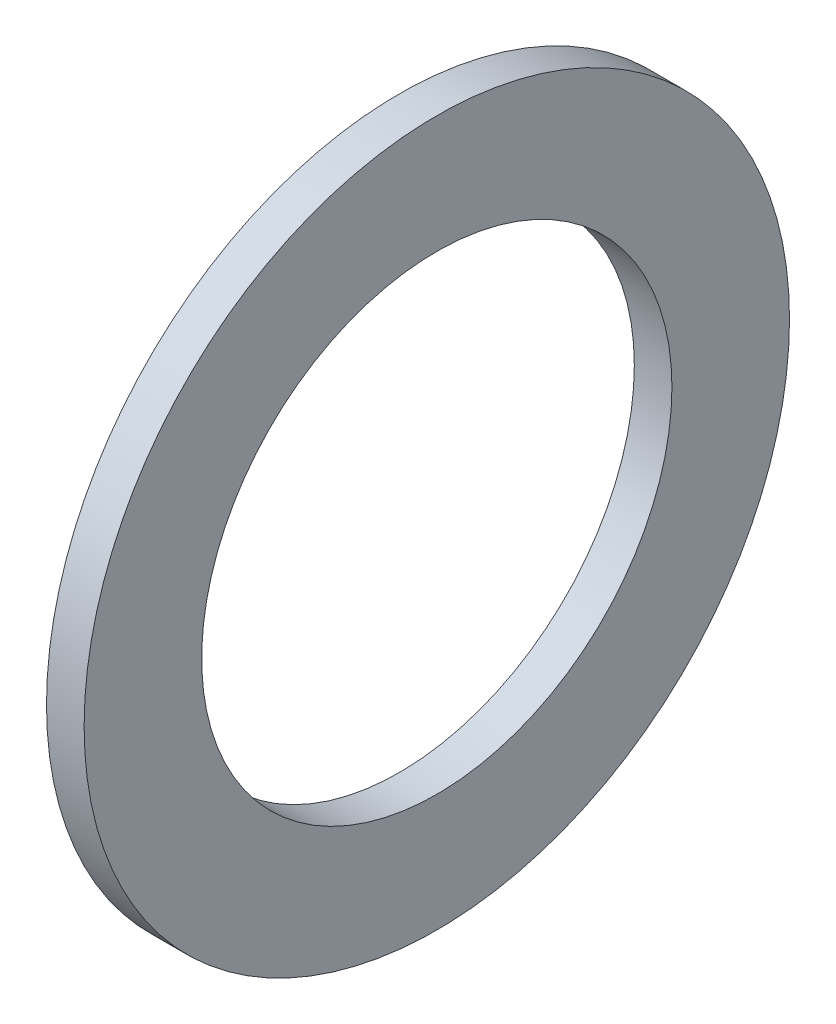
ISO-10303-21;
HEADER;
FILE_DESCRIPTION(('STEP AP214'),'2;1');
FILE_NAME('part.step','',(''),(''),'','','');
FILE_SCHEMA(('AUTOMOTIVE_DESIGN { 1 0 10303 214 1 1 1 1 }'));
ENDSEC;
DATA;
#1=APPLICATION_CONTEXT('core data for automotive mechanical design processes');
#2=APPLICATION_PROTOCOL_DEFINITION('international standard','automotive_design',2000,#1);
#3=PRODUCT_CONTEXT('',#1,'mechanical');
#4=PRODUCT('Part','Part','',(#3));
#5=PRODUCT_RELATED_PRODUCT_CATEGORY('part','',(#4));
#6=PRODUCT_DEFINITION_FORMATION('','',#4);
#7=PRODUCT_DEFINITION_CONTEXT('part definition',#1,'design');
#8=PRODUCT_DEFINITION('design','',#6,#7);
#9=PRODUCT_DEFINITION_SHAPE('','',#8);
#10=(LENGTH_UNIT() NAMED_UNIT(*) SI_UNIT(.MILLI.,.METRE.));
#11=(NAMED_UNIT(*) PLANE_ANGLE_UNIT() SI_UNIT($,.RADIAN.));
#12=(NAMED_UNIT(*) SI_UNIT($,.STERADIAN.) SOLID_ANGLE_UNIT());
#13=UNCERTAINTY_MEASURE_WITH_UNIT(LENGTH_MEASURE(1.E-05),#10,'distance_accuracy_value','');
#14=(GEOMETRIC_REPRESENTATION_CONTEXT(3) GLOBAL_UNCERTAINTY_ASSIGNED_CONTEXT((#13)) GLOBAL_UNIT_ASSIGNED_CONTEXT((#10,
#11,#12)) REPRESENTATION_CONTEXT('',''));
#15=CARTESIAN_POINT('',(0.,0.,0.));
#16=DIRECTION('',(0.,0.,1.));
#17=DIRECTION('',(1.,0.,0.));
#18=AXIS2_PLACEMENT_3D('',#15,#16,#17);
#19=CARTESIAN_POINT('',(0.508,0.,0.));
#20=DIRECTION('',(1.,0.,0.));
#21=DIRECTION('',(0.,0.,-1.));
#22=AXIS2_PLACEMENT_3D('',#19,#20,#21);
#23=PLANE('',#22);
#24=CARTESIAN_POINT('',(0.508,0.,0.));
#25=DIRECTION('',(1.,0.,0.));
#26=DIRECTION('',(0.,0.,-1.));
#27=AXIS2_PLACEMENT_3D('',#24,#25,#26);
#28=CIRCLE('',#27,4.7625);
#29=CARTESIAN_POINT('',(0.508,0.,-4.7625));
#30=VERTEX_POINT('',#29);
#31=EDGE_CURVE('E10',#30,#30,#28,.T.);
#32=ORIENTED_EDGE('',*,*,#31,.T.);
#33=EDGE_LOOP('',(#32));
#34=FACE_BOUND('',#33,.T.);
#35=CARTESIAN_POINT('',(0.508,0.,0.));
#36=DIRECTION('',(1.,0.,0.));
#37=DIRECTION('',(0.,0.,-1.));
#38=AXIS2_PLACEMENT_3D('',#35,#36,#37);
#39=CIRCLE('',#38,3.175);
#40=CARTESIAN_POINT('',(0.508,0.,-3.175));
#41=VERTEX_POINT('',#40);
#42=EDGE_CURVE('E41',#41,#41,#39,.T.);
#43=ORIENTED_EDGE('',*,*,#42,.F.);
#44=EDGE_LOOP('',(#43));
#45=FACE_BOUND('',#44,.T.);
#46=ADVANCED_FACE('F30',(#34,#45),#23,.T.);
#47=CARTESIAN_POINT('',(0.,0.,0.));
#48=DIRECTION('',(1.,0.,0.));
#49=DIRECTION('',(0.,0.,-1.));
#50=AXIS2_PLACEMENT_3D('',#47,#48,#49);
#51=PLANE('',#50);
#52=CARTESIAN_POINT('',(0.,0.,0.));
#53=DIRECTION('',(1.,0.,0.));
#54=DIRECTION('',(0.,0.,-1.));
#55=AXIS2_PLACEMENT_3D('',#52,#53,#54);
#56=CIRCLE('',#55,4.7625);
#57=CARTESIAN_POINT('',(0.,0.,-4.7625));
#58=VERTEX_POINT('',#57);
#59=EDGE_CURVE('E34',#58,#58,#56,.T.);
#60=ORIENTED_EDGE('',*,*,#59,.F.);
#61=EDGE_LOOP('',(#60));
#62=FACE_BOUND('',#61,.T.);
#63=CARTESIAN_POINT('',(0.,0.,0.));
#64=DIRECTION('',(1.,0.,0.));
#65=DIRECTION('',(0.,0.,-1.));
#66=AXIS2_PLACEMENT_3D('',#63,#64,#65);
#67=CIRCLE('',#66,3.175);
#68=CARTESIAN_POINT('',(0.,0.,-3.175));
#69=VERTEX_POINT('',#68);
#70=EDGE_CURVE('E43',#69,#69,#67,.T.);
#71=ORIENTED_EDGE('',*,*,#70,.T.);
#72=EDGE_LOOP('',(#71));
#73=FACE_BOUND('',#72,.T.);
#74=ADVANCED_FACE('F53',(#62,#73),#51,.F.);
#75=CARTESIAN_POINT('',(0.508,0.,0.));
#76=DIRECTION('',(-1.,0.,0.));
#77=DIRECTION('',(0.,0.,1.));
#78=AXIS2_PLACEMENT_3D('',#75,#76,#77);
#79=CYLINDRICAL_SURFACE('',#78,4.7625);
#80=ORIENTED_EDGE('',*,*,#31,.F.);
#81=EDGE_LOOP('',(#80));
#82=FACE_BOUND('',#81,.T.);
#83=ORIENTED_EDGE('',*,*,#59,.T.);
#84=EDGE_LOOP('',(#83));
#85=FACE_BOUND('',#84,.T.);
#86=ADVANCED_FACE('F32',(#82,#85),#79,.T.);
#87=CARTESIAN_POINT('',(0.508,0.,0.));
#88=DIRECTION('',(-1.,0.,0.));
#89=DIRECTION('',(0.,0.,1.));
#90=AXIS2_PLACEMENT_3D('',#87,#88,#89);
#91=CYLINDRICAL_SURFACE('',#90,3.175);
#92=ORIENTED_EDGE('',*,*,#42,.T.);
#93=EDGE_LOOP('',(#92));
#94=FACE_BOUND('',#93,.T.);
#95=ORIENTED_EDGE('',*,*,#70,.F.);
#96=EDGE_LOOP('',(#95));
#97=FACE_BOUND('',#96,.T.);
#98=ADVANCED_FACE('F49',(#94,#97),#91,.F.);
#99=CLOSED_SHELL('',(#46,#74,#86,#98));
#100=MANIFOLD_SOLID_BREP('B2',#99);
#101=ADVANCED_BREP_SHAPE_REPRESENTATION('',(#18,#100),#14);
#102=SHAPE_DEFINITION_REPRESENTATION(#9,#101);
ENDSEC;
END-ISO-10303-21;
